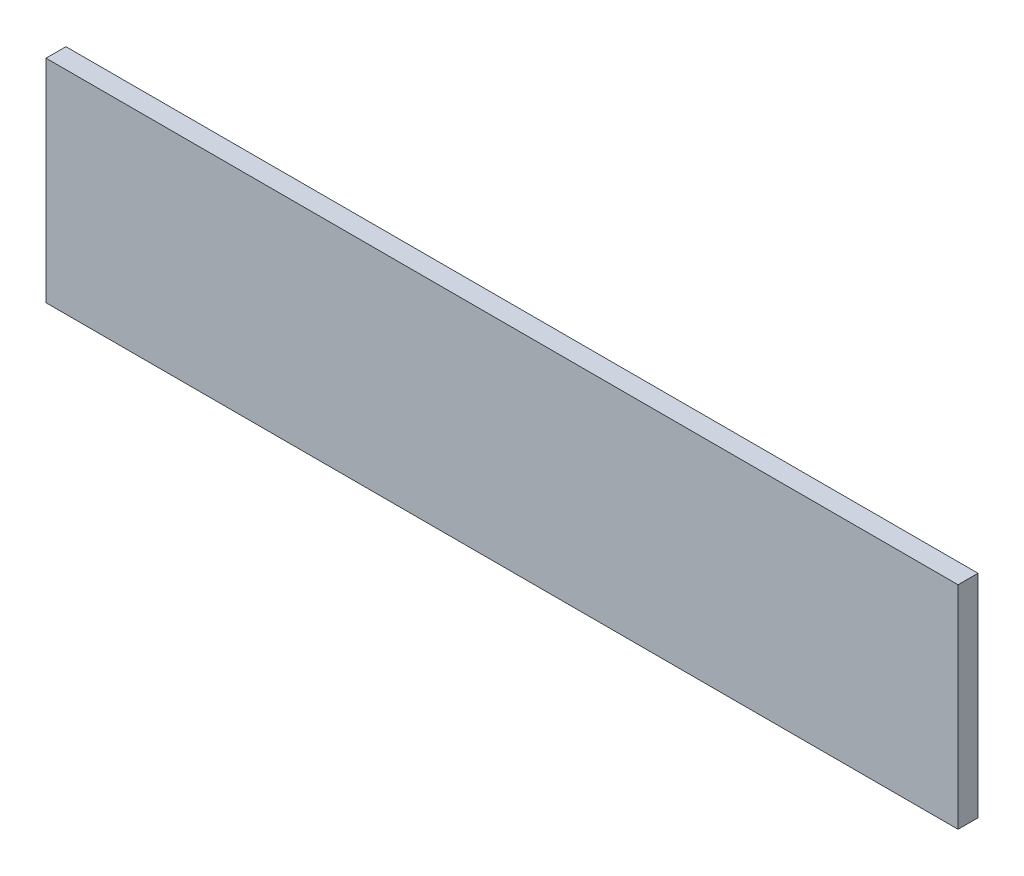
ISO-10303-21;
HEADER;
FILE_DESCRIPTION(('STEP AP214'),'2;1');
FILE_NAME('part.step','',(''),(''),'','','');
FILE_SCHEMA(('AUTOMOTIVE_DESIGN { 1 0 10303 214 1 1 1 1 }'));
ENDSEC;
DATA;
#1=APPLICATION_CONTEXT('core data for automotive mechanical design processes');
#2=APPLICATION_PROTOCOL_DEFINITION('international standard','automotive_design',2000,#1);
#3=PRODUCT_CONTEXT('',#1,'mechanical');
#4=PRODUCT('Part','Part','',(#3));
#5=PRODUCT_RELATED_PRODUCT_CATEGORY('part','',(#4));
#6=PRODUCT_DEFINITION_FORMATION('','',#4);
#7=PRODUCT_DEFINITION_CONTEXT('part definition',#1,'design');
#8=PRODUCT_DEFINITION('design','',#6,#7);
#9=PRODUCT_DEFINITION_SHAPE('','',#8);
#10=(LENGTH_UNIT() NAMED_UNIT(*) SI_UNIT(.MILLI.,.METRE.));
#11=(NAMED_UNIT(*) PLANE_ANGLE_UNIT() SI_UNIT($,.RADIAN.));
#12=(NAMED_UNIT(*) SI_UNIT($,.STERADIAN.) SOLID_ANGLE_UNIT());
#13=UNCERTAINTY_MEASURE_WITH_UNIT(LENGTH_MEASURE(1.E-05),#10,'distance_accuracy_value','');
#14=(GEOMETRIC_REPRESENTATION_CONTEXT(3) GLOBAL_UNCERTAINTY_ASSIGNED_CONTEXT((#13)) GLOBAL_UNIT_ASSIGNED_CONTEXT((#10,
#11,#12)) REPRESENTATION_CONTEXT('',''));
#15=CARTESIAN_POINT('',(0.,0.,0.));
#16=DIRECTION('',(0.,0.,1.));
#17=DIRECTION('',(1.,0.,0.));
#18=AXIS2_PLACEMENT_3D('',#15,#16,#17);
#19=CARTESIAN_POINT('',(0.,0.,-12.7));
#20=DIRECTION('',(0.,0.,-1.));
#21=DIRECTION('',(-1.,0.,0.));
#22=AXIS2_PLACEMENT_3D('',#19,#20,#21);
#23=PLANE('',#22);
#24=DIRECTION('',(1.,0.,0.));
#25=VECTOR('',#24,1.);
#26=CARTESIAN_POINT('',(0.,0.,-12.7));
#27=LINE('',#26,#25);
#28=CARTESIAN_POINT('',(0.,0.,-12.7));
#29=VERTEX_POINT('',#28);
#30=CARTESIAN_POINT('',(581.025,0.,-12.7));
#31=VERTEX_POINT('',#30);
#32=EDGE_CURVE('E20',#29,#31,#27,.T.);
#33=ORIENTED_EDGE('',*,*,#32,.F.);
#34=DIRECTION('',(0.,1.,0.));
#35=VECTOR('',#34,1.);
#36=CARTESIAN_POINT('',(0.,0.,-12.7));
#37=LINE('',#36,#35);
#38=CARTESIAN_POINT('',(0.,134.9375,-12.7));
#39=VERTEX_POINT('',#38);
#40=EDGE_CURVE('E80',#29,#39,#37,.T.);
#41=ORIENTED_EDGE('',*,*,#40,.T.);
#42=DIRECTION('',(1.,0.,0.));
#43=VECTOR('',#42,1.);
#44=CARTESIAN_POINT('',(0.,134.9375,-12.7));
#45=LINE('',#44,#43);
#46=CARTESIAN_POINT('',(581.025,134.9375,-12.7));
#47=VERTEX_POINT('',#46);
#48=EDGE_CURVE('E61',#47,#39,#45,.F.);
#49=ORIENTED_EDGE('',*,*,#48,.F.);
#50=DIRECTION('',(0.,1.,0.));
#51=VECTOR('',#50,1.);
#52=CARTESIAN_POINT('',(581.025,0.,-12.7));
#53=LINE('',#52,#51);
#54=EDGE_CURVE('E56',#31,#47,#53,.T.);
#55=ORIENTED_EDGE('',*,*,#54,.F.);
#56=EDGE_LOOP('',(#33,#41,#49,#55));
#57=FACE_BOUND('',#56,.T.);
#58=ADVANCED_FACE('F17',(#57),#23,.T.);
#59=CARTESIAN_POINT('',(0.,0.,0.));
#60=DIRECTION('',(0.,-1.,0.));
#61=DIRECTION('',(0.,0.,-1.));
#62=AXIS2_PLACEMENT_3D('',#59,#60,#61);
#63=PLANE('',#62);
#64=DIRECTION('',(1.,0.,0.));
#65=VECTOR('',#64,1.);
#66=CARTESIAN_POINT('',(0.,0.,0.));
#67=LINE('',#66,#65);
#68=CARTESIAN_POINT('',(0.,0.,0.));
#69=VERTEX_POINT('',#68);
#70=CARTESIAN_POINT('',(581.025,0.,0.));
#71=VERTEX_POINT('',#70);
#72=EDGE_CURVE('E83',#69,#71,#67,.T.);
#73=ORIENTED_EDGE('',*,*,#72,.F.);
#74=DIRECTION('',(0.,0.,-1.));
#75=VECTOR('',#74,1.);
#76=CARTESIAN_POINT('',(0.,0.,0.));
#77=LINE('',#76,#75);
#78=EDGE_CURVE('E68',#69,#29,#77,.T.);
#79=ORIENTED_EDGE('',*,*,#78,.T.);
#80=ORIENTED_EDGE('',*,*,#32,.T.);
#81=DIRECTION('',(0.,0.,-1.));
#82=VECTOR('',#81,1.);
#83=CARTESIAN_POINT('',(581.025,0.,0.));
#84=LINE('',#83,#82);
#85=EDGE_CURVE('E63',#71,#31,#84,.T.);
#86=ORIENTED_EDGE('',*,*,#85,.F.);
#87=EDGE_LOOP('',(#73,#79,#80,#86));
#88=FACE_BOUND('',#87,.T.);
#89=ADVANCED_FACE('F65',(#88),#63,.T.);
#90=CARTESIAN_POINT('',(581.025,0.,0.));
#91=DIRECTION('',(1.,0.,0.));
#92=DIRECTION('',(0.,0.,-1.));
#93=AXIS2_PLACEMENT_3D('',#90,#91,#92);
#94=PLANE('',#93);
#95=DIRECTION('',(0.,1.,0.));
#96=VECTOR('',#95,1.);
#97=CARTESIAN_POINT('',(581.025,134.9375,0.));
#98=LINE('',#97,#96);
#99=CARTESIAN_POINT('',(581.025,134.9375,0.));
#100=VERTEX_POINT('',#99);
#101=EDGE_CURVE('E72',#71,#100,#98,.T.);
#102=ORIENTED_EDGE('',*,*,#101,.F.);
#103=ORIENTED_EDGE('',*,*,#85,.T.);
#104=ORIENTED_EDGE('',*,*,#54,.T.);
#105=DIRECTION('',(0.,0.,1.));
#106=VECTOR('',#105,1.);
#107=CARTESIAN_POINT('',(581.025,134.9375,-12.7));
#108=LINE('',#107,#106);
#109=EDGE_CURVE('E74',#100,#47,#108,.F.);
#110=ORIENTED_EDGE('',*,*,#109,.F.);
#111=EDGE_LOOP('',(#102,#103,#104,#110));
#112=FACE_BOUND('',#111,.T.);
#113=ADVANCED_FACE('F70',(#112),#94,.T.);
#114=CARTESIAN_POINT('',(0.,134.9375,-12.7));
#115=DIRECTION('',(0.,1.,0.));
#116=DIRECTION('',(0.,0.,1.));
#117=AXIS2_PLACEMENT_3D('',#114,#115,#116);
#118=PLANE('',#117);
#119=ORIENTED_EDGE('',*,*,#48,.T.);
#120=DIRECTION('',(0.,0.,-1.));
#121=VECTOR('',#120,1.);
#122=CARTESIAN_POINT('',(0.,134.9375,0.));
#123=LINE('',#122,#121);
#124=CARTESIAN_POINT('',(0.,134.9375,0.));
#125=VERTEX_POINT('',#124);
#126=EDGE_CURVE('E35',#39,#125,#123,.F.);
#127=ORIENTED_EDGE('',*,*,#126,.T.);
#128=DIRECTION('',(1.,0.,0.));
#129=VECTOR('',#128,1.);
#130=CARTESIAN_POINT('',(0.,134.9375,0.));
#131=LINE('',#130,#129);
#132=EDGE_CURVE('E26',#100,#125,#131,.F.);
#133=ORIENTED_EDGE('',*,*,#132,.F.);
#134=ORIENTED_EDGE('',*,*,#109,.T.);
#135=EDGE_LOOP('',(#119,#127,#133,#134));
#136=FACE_BOUND('',#135,.T.);
#137=ADVANCED_FACE('F89',(#136),#118,.T.);
#138=CARTESIAN_POINT('',(0.,0.,0.));
#139=DIRECTION('',(1.,0.,0.));
#140=DIRECTION('',(0.,0.,-1.));
#141=AXIS2_PLACEMENT_3D('',#138,#139,#140);
#142=PLANE('',#141);
#143=ORIENTED_EDGE('',*,*,#126,.F.);
#144=ORIENTED_EDGE('',*,*,#40,.F.);
#145=ORIENTED_EDGE('',*,*,#78,.F.);
#146=DIRECTION('',(0.,1.,0.));
#147=VECTOR('',#146,1.);
#148=CARTESIAN_POINT('',(0.,134.9375,0.));
#149=LINE('',#148,#147);
#150=EDGE_CURVE('E11',#125,#69,#149,.F.);
#151=ORIENTED_EDGE('',*,*,#150,.F.);
#152=EDGE_LOOP('',(#143,#144,#145,#151));
#153=FACE_BOUND('',#152,.T.);
#154=ADVANCED_FACE('F91',(#153),#142,.F.);
#155=CARTESIAN_POINT('',(0.,134.9375,0.));
#156=DIRECTION('',(0.,0.,1.));
#157=DIRECTION('',(1.,0.,0.));
#158=AXIS2_PLACEMENT_3D('',#155,#156,#157);
#159=PLANE('',#158);
#160=ORIENTED_EDGE('',*,*,#132,.T.);
#161=ORIENTED_EDGE('',*,*,#150,.T.);
#162=ORIENTED_EDGE('',*,*,#72,.T.);
#163=ORIENTED_EDGE('',*,*,#101,.T.);
#164=EDGE_LOOP('',(#160,#161,#162,#163));
#165=FACE_BOUND('',#164,.T.);
#166=ADVANCED_FACE('F88',(#165),#159,.T.);
#167=CLOSED_SHELL('',(#58,#89,#113,#137,#154,#166));
#168=MANIFOLD_SOLID_BREP('B1',#167);
#169=ADVANCED_BREP_SHAPE_REPRESENTATION('',(#18,#168),#14);
#170=SHAPE_DEFINITION_REPRESENTATION(#9,#169);
ENDSEC;
END-ISO-10303-21;
